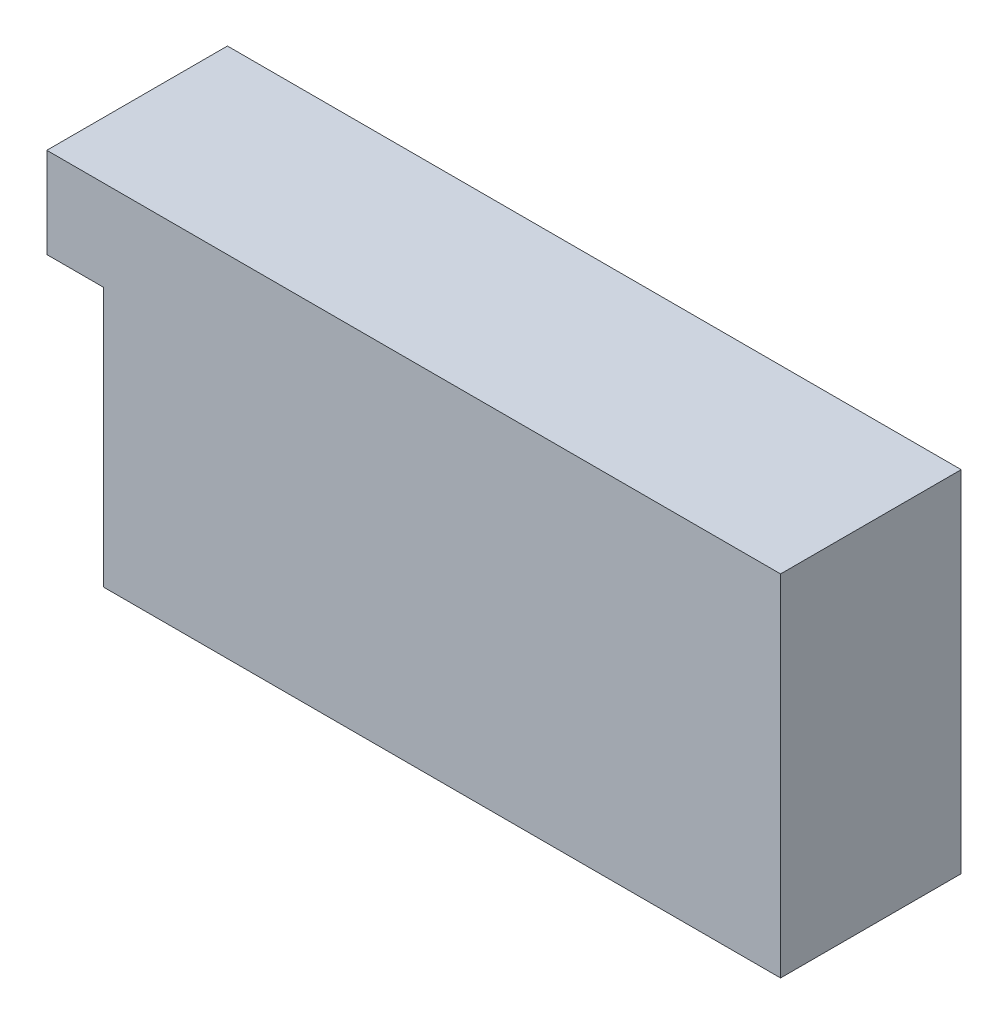
ISO-10303-21;
HEADER;
FILE_DESCRIPTION(('STEP AP214'),'2;1');
FILE_NAME('part.step','',(''),(''),'','','');
FILE_SCHEMA(('AUTOMOTIVE_DESIGN { 1 0 10303 214 1 1 1 1 }'));
ENDSEC;
DATA;
#1=APPLICATION_CONTEXT('core data for automotive mechanical design processes');
#2=APPLICATION_PROTOCOL_DEFINITION('international standard','automotive_design',2000,#1);
#3=PRODUCT_CONTEXT('',#1,'mechanical');
#4=PRODUCT('Part','Part','',(#3));
#5=PRODUCT_RELATED_PRODUCT_CATEGORY('part','',(#4));
#6=PRODUCT_DEFINITION_FORMATION('','',#4);
#7=PRODUCT_DEFINITION_CONTEXT('part definition',#1,'design');
#8=PRODUCT_DEFINITION('design','',#6,#7);
#9=PRODUCT_DEFINITION_SHAPE('','',#8);
#10=(LENGTH_UNIT() NAMED_UNIT(*) SI_UNIT(.MILLI.,.METRE.));
#11=(NAMED_UNIT(*) PLANE_ANGLE_UNIT() SI_UNIT($,.RADIAN.));
#12=(NAMED_UNIT(*) SI_UNIT($,.STERADIAN.) SOLID_ANGLE_UNIT());
#13=UNCERTAINTY_MEASURE_WITH_UNIT(LENGTH_MEASURE(1.E-05),#10,'distance_accuracy_value','');
#14=(GEOMETRIC_REPRESENTATION_CONTEXT(3) GLOBAL_UNCERTAINTY_ASSIGNED_CONTEXT((#13)) GLOBAL_UNIT_ASSIGNED_CONTEXT((#10,
#11,#12)) REPRESENTATION_CONTEXT('',''));
#15=CARTESIAN_POINT('',(0.,0.,0.));
#16=DIRECTION('',(0.,0.,1.));
#17=DIRECTION('',(1.,0.,0.));
#18=AXIS2_PLACEMENT_3D('',#15,#16,#17);
#19=CARTESIAN_POINT('',(0.,0.,16.));
#20=DIRECTION('',(1.,0.,0.));
#21=DIRECTION('',(0.,1.,0.));
#22=AXIS2_PLACEMENT_3D('',#19,#20,#21);
#23=PLANE('',#22);
#24=DIRECTION('',(0.,0.,1.));
#25=VECTOR('',#24,1.);
#26=CARTESIAN_POINT('',(0.,23.,0.));
#27=LINE('',#26,#25);
#28=CARTESIAN_POINT('',(0.,23.,0.));
#29=VERTEX_POINT('',#28);
#30=CARTESIAN_POINT('',(0.,23.,16.));
#31=VERTEX_POINT('',#30);
#32=EDGE_CURVE('E47',#29,#31,#27,.T.);
#33=ORIENTED_EDGE('',*,*,#32,.F.);
#34=DIRECTION('',(0.,-1.,0.));
#35=VECTOR('',#34,1.);
#36=CARTESIAN_POINT('',(0.,0.,0.));
#37=LINE('',#36,#35);
#38=CARTESIAN_POINT('',(0.,0.,0.));
#39=VERTEX_POINT('',#38);
#40=EDGE_CURVE('E115',#29,#39,#37,.T.);
#41=ORIENTED_EDGE('',*,*,#40,.T.);
#42=DIRECTION('',(0.,0.,-1.));
#43=VECTOR('',#42,1.);
#44=CARTESIAN_POINT('',(0.,0.,16.));
#45=LINE('',#44,#43);
#46=CARTESIAN_POINT('',(0.,0.,16.));
#47=VERTEX_POINT('',#46);
#48=EDGE_CURVE('E11',#47,#39,#45,.T.);
#49=ORIENTED_EDGE('',*,*,#48,.F.);
#50=DIRECTION('',(0.,-1.,0.));
#51=VECTOR('',#50,1.);
#52=CARTESIAN_POINT('',(0.,0.,16.));
#53=LINE('',#52,#51);
#54=EDGE_CURVE('E76',#31,#47,#53,.T.);
#55=ORIENTED_EDGE('',*,*,#54,.F.);
#56=EDGE_LOOP('',(#33,#41,#49,#55));
#57=FACE_BOUND('',#56,.T.);
#58=ADVANCED_FACE('F33',(#57),#23,.F.);
#59=CARTESIAN_POINT('',(0.,0.,16.));
#60=DIRECTION('',(0.,1.,0.));
#61=DIRECTION('',(0.,0.,1.));
#62=AXIS2_PLACEMENT_3D('',#59,#60,#61);
#63=PLANE('',#62);
#64=DIRECTION('',(1.,0.,0.));
#65=VECTOR('',#64,1.);
#66=CARTESIAN_POINT('',(0.,0.,0.));
#67=LINE('',#66,#65);
#68=CARTESIAN_POINT('',(60.,0.,0.));
#69=VERTEX_POINT('',#68);
#70=EDGE_CURVE('E117',#39,#69,#67,.T.);
#71=ORIENTED_EDGE('',*,*,#70,.T.);
#72=DIRECTION('',(0.,0.,-1.));
#73=VECTOR('',#72,1.);
#74=CARTESIAN_POINT('',(60.,0.,16.));
#75=LINE('',#74,#73);
#76=CARTESIAN_POINT('',(60.,0.,16.));
#77=VERTEX_POINT('',#76);
#78=EDGE_CURVE('E40',#77,#69,#75,.T.);
#79=ORIENTED_EDGE('',*,*,#78,.F.);
#80=DIRECTION('',(1.,0.,0.));
#81=VECTOR('',#80,1.);
#82=CARTESIAN_POINT('',(0.,0.,16.));
#83=LINE('',#82,#81);
#84=EDGE_CURVE('E123',#47,#77,#83,.T.);
#85=ORIENTED_EDGE('',*,*,#84,.F.);
#86=ORIENTED_EDGE('',*,*,#48,.T.);
#87=EDGE_LOOP('',(#71,#79,#85,#86));
#88=FACE_BOUND('',#87,.T.);
#89=ADVANCED_FACE('F152',(#88),#63,.F.);
#90=CARTESIAN_POINT('',(60.,0.,16.));
#91=DIRECTION('',(-1.,0.,0.));
#92=DIRECTION('',(0.,-1.,0.));
#93=AXIS2_PLACEMENT_3D('',#90,#91,#92);
#94=PLANE('',#93);
#95=DIRECTION('',(0.,1.,0.));
#96=VECTOR('',#95,1.);
#97=CARTESIAN_POINT('',(60.,0.,0.));
#98=LINE('',#97,#96);
#99=CARTESIAN_POINT('',(60.,31.,0.));
#100=VERTEX_POINT('',#99);
#101=EDGE_CURVE('E72',#69,#100,#98,.T.);
#102=ORIENTED_EDGE('',*,*,#101,.T.);
#103=DIRECTION('',(0.,0.,-1.));
#104=VECTOR('',#103,1.);
#105=CARTESIAN_POINT('',(60.,31.,16.));
#106=LINE('',#105,#104);
#107=CARTESIAN_POINT('',(60.,31.,16.));
#108=VERTEX_POINT('',#107);
#109=EDGE_CURVE('E128',#108,#100,#106,.T.);
#110=ORIENTED_EDGE('',*,*,#109,.F.);
#111=DIRECTION('',(0.,1.,0.));
#112=VECTOR('',#111,1.);
#113=CARTESIAN_POINT('',(60.,0.,16.));
#114=LINE('',#113,#112);
#115=EDGE_CURVE('E56',#77,#108,#114,.T.);
#116=ORIENTED_EDGE('',*,*,#115,.F.);
#117=ORIENTED_EDGE('',*,*,#78,.T.);
#118=EDGE_LOOP('',(#102,#110,#116,#117));
#119=FACE_BOUND('',#118,.T.);
#120=ADVANCED_FACE('F134',(#119),#94,.F.);
#121=CARTESIAN_POINT('',(0.,31.,16.));
#122=DIRECTION('',(0.,-1.,0.));
#123=DIRECTION('',(0.,0.,-1.));
#124=AXIS2_PLACEMENT_3D('',#121,#122,#123);
#125=PLANE('',#124);
#126=DIRECTION('',(-1.,0.,0.));
#127=VECTOR('',#126,1.);
#128=CARTESIAN_POINT('',(0.,31.,0.));
#129=LINE('',#128,#127);
#130=CARTESIAN_POINT('',(-5.00000000000001,31.,0.));
#131=VERTEX_POINT('',#130);
#132=EDGE_CURVE('E124',#100,#131,#129,.T.);
#133=ORIENTED_EDGE('',*,*,#132,.T.);
#134=DIRECTION('',(0.,0.,-1.));
#135=VECTOR('',#134,1.);
#136=CARTESIAN_POINT('',(-5.00000000000001,31.,0.));
#137=LINE('',#136,#135);
#138=CARTESIAN_POINT('',(-5.00000000000001,31.,16.));
#139=VERTEX_POINT('',#138);
#140=EDGE_CURVE('E109',#139,#131,#137,.T.);
#141=ORIENTED_EDGE('',*,*,#140,.F.);
#142=DIRECTION('',(-1.,0.,0.));
#143=VECTOR('',#142,1.);
#144=CARTESIAN_POINT('',(0.,31.,16.));
#145=LINE('',#144,#143);
#146=EDGE_CURVE('E127',#108,#139,#145,.T.);
#147=ORIENTED_EDGE('',*,*,#146,.F.);
#148=ORIENTED_EDGE('',*,*,#109,.T.);
#149=EDGE_LOOP('',(#133,#141,#147,#148));
#150=FACE_BOUND('',#149,.T.);
#151=ADVANCED_FACE('F137',(#150),#125,.F.);
#152=CARTESIAN_POINT('',(0.,0.,16.));
#153=DIRECTION('',(0.,0.,-1.));
#154=DIRECTION('',(-1.,0.,0.));
#155=AXIS2_PLACEMENT_3D('',#152,#153,#154);
#156=PLANE('',#155);
#157=ORIENTED_EDGE('',*,*,#146,.T.);
#158=DIRECTION('',(0.,1.,0.));
#159=VECTOR('',#158,1.);
#160=CARTESIAN_POINT('',(-5.00000000000001,31.,16.));
#161=LINE('',#160,#159);
#162=CARTESIAN_POINT('',(-5.00000000000001,23.,16.));
#163=VERTEX_POINT('',#162);
#164=EDGE_CURVE('E102',#163,#139,#161,.T.);
#165=ORIENTED_EDGE('',*,*,#164,.F.);
#166=DIRECTION('',(1.,0.,0.));
#167=VECTOR('',#166,1.);
#168=CARTESIAN_POINT('',(-5.00000000000001,23.,16.));
#169=LINE('',#168,#167);
#170=EDGE_CURVE('E98',#163,#31,#169,.T.);
#171=ORIENTED_EDGE('',*,*,#170,.T.);
#172=ORIENTED_EDGE('',*,*,#54,.T.);
#173=ORIENTED_EDGE('',*,*,#84,.T.);
#174=ORIENTED_EDGE('',*,*,#115,.T.);
#175=EDGE_LOOP('',(#157,#165,#171,#172,#173,#174));
#176=FACE_BOUND('',#175,.T.);
#177=ADVANCED_FACE('F139',(#176),#156,.F.);
#178=CARTESIAN_POINT('',(0.,0.,0.));
#179=DIRECTION('',(0.,0.,-1.));
#180=DIRECTION('',(-1.,0.,0.));
#181=AXIS2_PLACEMENT_3D('',#178,#179,#180);
#182=PLANE('',#181);
#183=ORIENTED_EDGE('',*,*,#40,.F.);
#184=DIRECTION('',(1.,0.,0.));
#185=VECTOR('',#184,1.);
#186=CARTESIAN_POINT('',(-5.00000000000001,23.,0.));
#187=LINE('',#186,#185);
#188=CARTESIAN_POINT('',(-5.00000000000001,23.,0.));
#189=VERTEX_POINT('',#188);
#190=EDGE_CURVE('E97',#189,#29,#187,.T.);
#191=ORIENTED_EDGE('',*,*,#190,.F.);
#192=DIRECTION('',(0.,-1.,0.));
#193=VECTOR('',#192,1.);
#194=CARTESIAN_POINT('',(-5.00000000000001,31.,0.));
#195=LINE('',#194,#193);
#196=EDGE_CURVE('E103',#131,#189,#195,.T.);
#197=ORIENTED_EDGE('',*,*,#196,.F.);
#198=ORIENTED_EDGE('',*,*,#132,.F.);
#199=ORIENTED_EDGE('',*,*,#101,.F.);
#200=ORIENTED_EDGE('',*,*,#70,.F.);
#201=EDGE_LOOP('',(#183,#191,#197,#198,#199,#200));
#202=FACE_BOUND('',#201,.T.);
#203=ADVANCED_FACE('F113',(#202),#182,.T.);
#204=CARTESIAN_POINT('',(-5.00000000000001,23.,0.));
#205=DIRECTION('',(0.,1.,0.));
#206=DIRECTION('',(-1.,0.,0.));
#207=AXIS2_PLACEMENT_3D('',#204,#205,#206);
#208=PLANE('',#207);
#209=ORIENTED_EDGE('',*,*,#32,.T.);
#210=ORIENTED_EDGE('',*,*,#170,.F.);
#211=DIRECTION('',(0.,0.,1.));
#212=VECTOR('',#211,1.);
#213=CARTESIAN_POINT('',(-5.00000000000001,23.,0.));
#214=LINE('',#213,#212);
#215=EDGE_CURVE('E93',#189,#163,#214,.T.);
#216=ORIENTED_EDGE('',*,*,#215,.F.);
#217=ORIENTED_EDGE('',*,*,#190,.T.);
#218=EDGE_LOOP('',(#209,#210,#216,#217));
#219=FACE_BOUND('',#218,.T.);
#220=ADVANCED_FACE('F95',(#219),#208,.F.);
#221=CARTESIAN_POINT('',(-5.,0.,0.));
#222=DIRECTION('',(-1.,0.,0.));
#223=DIRECTION('',(0.,-1.,0.));
#224=AXIS2_PLACEMENT_3D('',#221,#222,#223);
#225=PLANE('',#224);
#226=ORIENTED_EDGE('',*,*,#196,.T.);
#227=ORIENTED_EDGE('',*,*,#215,.T.);
#228=ORIENTED_EDGE('',*,*,#164,.T.);
#229=ORIENTED_EDGE('',*,*,#140,.T.);
#230=EDGE_LOOP('',(#226,#227,#228,#229));
#231=FACE_BOUND('',#230,.T.);
#232=ADVANCED_FACE('F107',(#231),#225,.T.);
#233=CLOSED_SHELL('',(#58,#89,#120,#151,#177,#203,#220,#232));
#234=MANIFOLD_SOLID_BREP('B2',#233);
#235=ADVANCED_BREP_SHAPE_REPRESENTATION('',(#18,#234),#14);
#236=SHAPE_DEFINITION_REPRESENTATION(#9,#235);
ENDSEC;
END-ISO-10303-21;
